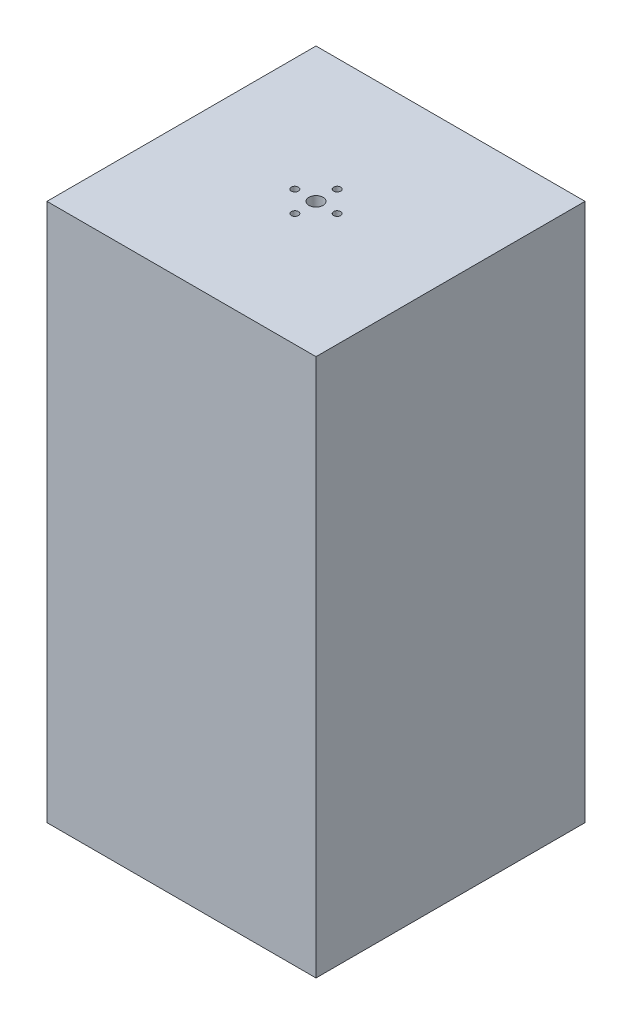
ISO-10303-21;
HEADER;
FILE_DESCRIPTION(('STEP AP214'),'2;1');
FILE_NAME('part.step','',(''),(''),'','','');
FILE_SCHEMA(('AUTOMOTIVE_DESIGN { 1 0 10303 214 1 1 1 1 }'));
ENDSEC;
DATA;
#1=APPLICATION_CONTEXT('core data for automotive mechanical design processes');
#2=APPLICATION_PROTOCOL_DEFINITION('international standard','automotive_design',2000,#1);
#3=PRODUCT_CONTEXT('',#1,'mechanical');
#4=PRODUCT('Part','Part','',(#3));
#5=PRODUCT_RELATED_PRODUCT_CATEGORY('part','',(#4));
#6=PRODUCT_DEFINITION_FORMATION('','',#4);
#7=PRODUCT_DEFINITION_CONTEXT('part definition',#1,'design');
#8=PRODUCT_DEFINITION('design','',#6,#7);
#9=PRODUCT_DEFINITION_SHAPE('','',#8);
#10=(LENGTH_UNIT() NAMED_UNIT(*) SI_UNIT(.MILLI.,.METRE.));
#11=(NAMED_UNIT(*) PLANE_ANGLE_UNIT() SI_UNIT($,.RADIAN.));
#12=(NAMED_UNIT(*) SI_UNIT($,.STERADIAN.) SOLID_ANGLE_UNIT());
#13=UNCERTAINTY_MEASURE_WITH_UNIT(LENGTH_MEASURE(1.E-05),#10,'distance_accuracy_value','');
#14=(GEOMETRIC_REPRESENTATION_CONTEXT(3) GLOBAL_UNCERTAINTY_ASSIGNED_CONTEXT((#13)) GLOBAL_UNIT_ASSIGNED_CONTEXT((#10,
#11,#12)) REPRESENTATION_CONTEXT('',''));
#15=CARTESIAN_POINT('',(0.,0.,0.));
#16=DIRECTION('',(0.,0.,1.));
#17=DIRECTION('',(1.,0.,0.));
#18=AXIS2_PLACEMENT_3D('',#15,#16,#17);
#19=CARTESIAN_POINT('',(0.,0.,-76.2));
#20=DIRECTION('',(-1.,0.,0.));
#21=DIRECTION('',(0.,0.,1.));
#22=AXIS2_PLACEMENT_3D('',#19,#20,#21);
#23=PLANE('',#22);
#24=DIRECTION('',(0.,-1.,0.));
#25=VECTOR('',#24,1.);
#26=CARTESIAN_POINT('',(0.,0.,0.));
#27=LINE('',#26,#25);
#28=CARTESIAN_POINT('',(0.,152.4,0.));
#29=VERTEX_POINT('',#28);
#30=CARTESIAN_POINT('',(0.,0.,0.));
#31=VERTEX_POINT('',#30);
#32=EDGE_CURVE('E145',#29,#31,#27,.T.);
#33=ORIENTED_EDGE('',*,*,#32,.F.);
#34=DIRECTION('',(0.,0.,1.));
#35=VECTOR('',#34,1.);
#36=CARTESIAN_POINT('',(0.,152.4,-76.2));
#37=LINE('',#36,#35);
#38=CARTESIAN_POINT('',(0.,152.4,-76.2));
#39=VERTEX_POINT('',#38);
#40=EDGE_CURVE('E11',#39,#29,#37,.T.);
#41=ORIENTED_EDGE('',*,*,#40,.F.);
#42=DIRECTION('',(0.,-1.,0.));
#43=VECTOR('',#42,1.);
#44=CARTESIAN_POINT('',(0.,0.,-76.2));
#45=LINE('',#44,#43);
#46=CARTESIAN_POINT('',(0.,0.,-76.2));
#47=VERTEX_POINT('',#46);
#48=EDGE_CURVE('E149',#39,#47,#45,.T.);
#49=ORIENTED_EDGE('',*,*,#48,.T.);
#50=DIRECTION('',(0.,0.,1.));
#51=VECTOR('',#50,1.);
#52=CARTESIAN_POINT('',(0.,0.,-76.2));
#53=LINE('',#52,#51);
#54=EDGE_CURVE('E83',#47,#31,#53,.T.);
#55=ORIENTED_EDGE('',*,*,#54,.T.);
#56=EDGE_LOOP('',(#33,#41,#49,#55));
#57=FACE_BOUND('',#56,.T.);
#58=ADVANCED_FACE('F34',(#57),#23,.T.);
#59=CARTESIAN_POINT('',(0.,152.4,-76.2));
#60=DIRECTION('',(0.,1.,0.));
#61=DIRECTION('',(-1.,0.,0.));
#62=AXIS2_PLACEMENT_3D('',#59,#60,#61);
#63=PLANE('',#62);
#64=CARTESIAN_POINT('',(38.1,152.4,-32.1));
#65=DIRECTION('',(0.,1.,0.));
#66=DIRECTION('',(-1.,0.,0.));
#67=AXIS2_PLACEMENT_3D('',#64,#65,#66);
#68=CIRCLE('',#67,0.999999999999998);
#69=CARTESIAN_POINT('',(37.1,152.4,-32.1));
#70=VERTEX_POINT('',#69);
#71=EDGE_CURVE('E177',#70,#70,#68,.T.);
#72=ORIENTED_EDGE('',*,*,#71,.F.);
#73=EDGE_LOOP('',(#72));
#74=FACE_BOUND('',#73,.T.);
#75=CARTESIAN_POINT('',(32.1,152.4,-38.1));
#76=DIRECTION('',(0.,1.,0.));
#77=DIRECTION('',(-1.,0.,0.));
#78=AXIS2_PLACEMENT_3D('',#75,#76,#77);
#79=CIRCLE('',#78,0.999999999999998);
#80=CARTESIAN_POINT('',(31.1,152.4,-38.1));
#81=VERTEX_POINT('',#80);
#82=EDGE_CURVE('E216',#81,#81,#79,.T.);
#83=ORIENTED_EDGE('',*,*,#82,.F.);
#84=EDGE_LOOP('',(#83));
#85=FACE_BOUND('',#84,.T.);
#86=CARTESIAN_POINT('',(44.1,152.4,-38.1));
#87=DIRECTION('',(0.,1.,0.));
#88=DIRECTION('',(-1.,0.,0.));
#89=AXIS2_PLACEMENT_3D('',#86,#87,#88);
#90=CIRCLE('',#89,0.999999999999998);
#91=CARTESIAN_POINT('',(43.1,152.4,-38.1));
#92=VERTEX_POINT('',#91);
#93=EDGE_CURVE('E214',#92,#92,#90,.T.);
#94=ORIENTED_EDGE('',*,*,#93,.F.);
#95=EDGE_LOOP('',(#94));
#96=FACE_BOUND('',#95,.T.);
#97=CARTESIAN_POINT('',(38.1,152.4,-38.1));
#98=DIRECTION('',(0.,1.,0.));
#99=DIRECTION('',(-1.,0.,0.));
#100=AXIS2_PLACEMENT_3D('',#97,#98,#99);
#101=CIRCLE('',#100,2.);
#102=CARTESIAN_POINT('',(36.1,152.4,-38.1));
#103=VERTEX_POINT('',#102);
#104=EDGE_CURVE('E133',#103,#103,#101,.T.);
#105=ORIENTED_EDGE('',*,*,#104,.F.);
#106=EDGE_LOOP('',(#105));
#107=FACE_BOUND('',#106,.T.);
#108=CARTESIAN_POINT('',(38.1,152.4,-44.1));
#109=DIRECTION('',(0.,1.,0.));
#110=DIRECTION('',(-1.,0.,0.));
#111=AXIS2_PLACEMENT_3D('',#108,#109,#110);
#112=CIRCLE('',#111,0.999999999999998);
#113=CARTESIAN_POINT('',(37.1,152.4,-44.1));
#114=VERTEX_POINT('',#113);
#115=EDGE_CURVE('E209',#114,#114,#112,.T.);
#116=ORIENTED_EDGE('',*,*,#115,.F.);
#117=EDGE_LOOP('',(#116));
#118=FACE_BOUND('',#117,.T.);
#119=DIRECTION('',(-1.,0.,0.));
#120=VECTOR('',#119,1.);
#121=CARTESIAN_POINT('',(0.,152.4,0.));
#122=LINE('',#121,#120);
#123=CARTESIAN_POINT('',(76.2,152.4,0.));
#124=VERTEX_POINT('',#123);
#125=EDGE_CURVE('E152',#124,#29,#122,.T.);
#126=ORIENTED_EDGE('',*,*,#125,.F.);
#127=DIRECTION('',(0.,0.,1.));
#128=VECTOR('',#127,1.);
#129=CARTESIAN_POINT('',(76.2,152.4,-76.2));
#130=LINE('',#129,#128);
#131=CARTESIAN_POINT('',(76.2,152.4,-76.2));
#132=VERTEX_POINT('',#131);
#133=EDGE_CURVE('E42',#132,#124,#130,.T.);
#134=ORIENTED_EDGE('',*,*,#133,.F.);
#135=DIRECTION('',(-1.,0.,0.));
#136=VECTOR('',#135,1.);
#137=CARTESIAN_POINT('',(0.,152.4,-76.2));
#138=LINE('',#137,#136);
#139=EDGE_CURVE('E157',#132,#39,#138,.T.);
#140=ORIENTED_EDGE('',*,*,#139,.T.);
#141=ORIENTED_EDGE('',*,*,#40,.T.);
#142=EDGE_LOOP('',(#126,#134,#140,#141));
#143=FACE_BOUND('',#142,.T.);
#144=ADVANCED_FACE('F224',(#74,#85,#96,#107,#118,#143),#63,.T.);
#145=CARTESIAN_POINT('',(76.2,0.,-76.2));
#146=DIRECTION('',(1.,0.,0.));
#147=DIRECTION('',(0.,0.,-1.));
#148=AXIS2_PLACEMENT_3D('',#145,#146,#147);
#149=PLANE('',#148);
#150=DIRECTION('',(0.,1.,0.));
#151=VECTOR('',#150,1.);
#152=CARTESIAN_POINT('',(76.2,0.,0.));
#153=LINE('',#152,#151);
#154=CARTESIAN_POINT('',(76.2,0.,0.));
#155=VERTEX_POINT('',#154);
#156=EDGE_CURVE('E164',#155,#124,#153,.T.);
#157=ORIENTED_EDGE('',*,*,#156,.F.);
#158=DIRECTION('',(0.,0.,1.));
#159=VECTOR('',#158,1.);
#160=CARTESIAN_POINT('',(76.2,0.,-76.2));
#161=LINE('',#160,#159);
#162=CARTESIAN_POINT('',(76.2,0.,-76.2));
#163=VERTEX_POINT('',#162);
#164=EDGE_CURVE('E170',#163,#155,#161,.T.);
#165=ORIENTED_EDGE('',*,*,#164,.F.);
#166=DIRECTION('',(0.,1.,0.));
#167=VECTOR('',#166,1.);
#168=CARTESIAN_POINT('',(76.2,0.,-76.2));
#169=LINE('',#168,#167);
#170=EDGE_CURVE('E154',#163,#132,#169,.T.);
#171=ORIENTED_EDGE('',*,*,#170,.T.);
#172=ORIENTED_EDGE('',*,*,#133,.T.);
#173=EDGE_LOOP('',(#157,#165,#171,#172));
#174=FACE_BOUND('',#173,.T.);
#175=ADVANCED_FACE('F227',(#174),#149,.T.);
#176=CARTESIAN_POINT('',(0.,0.,-76.2));
#177=DIRECTION('',(0.,-1.,0.));
#178=DIRECTION('',(0.,0.,-1.));
#179=AXIS2_PLACEMENT_3D('',#176,#177,#178);
#180=PLANE('',#179);
#181=DIRECTION('',(0.,0.,-1.));
#182=VECTOR('',#181,1.);
#183=CARTESIAN_POINT('',(3.81,0.,-3.81));
#184=LINE('',#183,#182);
#185=CARTESIAN_POINT('',(3.81,0.,-3.81));
#186=VERTEX_POINT('',#185);
#187=CARTESIAN_POINT('',(3.81000000000001,0.,-72.39));
#188=VERTEX_POINT('',#187);
#189=EDGE_CURVE('E50',#186,#188,#184,.T.);
#190=ORIENTED_EDGE('',*,*,#189,.F.);
#191=DIRECTION('',(-1.,0.,0.));
#192=VECTOR('',#191,1.);
#193=CARTESIAN_POINT('',(3.81,0.,-3.81));
#194=LINE('',#193,#192);
#195=CARTESIAN_POINT('',(72.39,0.,-3.81));
#196=VERTEX_POINT('',#195);
#197=EDGE_CURVE('E127',#196,#186,#194,.T.);
#198=ORIENTED_EDGE('',*,*,#197,.F.);
#199=DIRECTION('',(0.,0.,1.));
#200=VECTOR('',#199,1.);
#201=CARTESIAN_POINT('',(72.39,0.,-3.81));
#202=LINE('',#201,#200);
#203=CARTESIAN_POINT('',(72.39,0.,-72.39));
#204=VERTEX_POINT('',#203);
#205=EDGE_CURVE('E130',#204,#196,#202,.T.);
#206=ORIENTED_EDGE('',*,*,#205,.F.);
#207=DIRECTION('',(1.,0.,0.));
#208=VECTOR('',#207,1.);
#209=CARTESIAN_POINT('',(3.81000000000001,0.,-72.39));
#210=LINE('',#209,#208);
#211=EDGE_CURVE('E139',#188,#204,#210,.T.);
#212=ORIENTED_EDGE('',*,*,#211,.F.);
#213=EDGE_LOOP('',(#190,#198,#206,#212));
#214=FACE_BOUND('',#213,.T.);
#215=DIRECTION('',(1.,0.,0.));
#216=VECTOR('',#215,1.);
#217=CARTESIAN_POINT('',(0.,0.,0.));
#218=LINE('',#217,#216);
#219=EDGE_CURVE('E161',#31,#155,#218,.T.);
#220=ORIENTED_EDGE('',*,*,#219,.F.);
#221=ORIENTED_EDGE('',*,*,#54,.F.);
#222=DIRECTION('',(1.,0.,0.));
#223=VECTOR('',#222,1.);
#224=CARTESIAN_POINT('',(0.,0.,-76.2));
#225=LINE('',#224,#223);
#226=EDGE_CURVE('E151',#47,#163,#225,.T.);
#227=ORIENTED_EDGE('',*,*,#226,.T.);
#228=ORIENTED_EDGE('',*,*,#164,.T.);
#229=EDGE_LOOP('',(#220,#221,#227,#228));
#230=FACE_BOUND('',#229,.T.);
#231=ADVANCED_FACE('F239',(#214,#230),#180,.T.);
#232=CARTESIAN_POINT('',(0.,0.,-76.2));
#233=DIRECTION('',(0.,0.,-1.));
#234=DIRECTION('',(-1.,0.,0.));
#235=AXIS2_PLACEMENT_3D('',#232,#233,#234);
#236=PLANE('',#235);
#237=ORIENTED_EDGE('',*,*,#48,.F.);
#238=ORIENTED_EDGE('',*,*,#139,.F.);
#239=ORIENTED_EDGE('',*,*,#170,.F.);
#240=ORIENTED_EDGE('',*,*,#226,.F.);
#241=EDGE_LOOP('',(#237,#238,#239,#240));
#242=FACE_BOUND('',#241,.T.);
#243=ADVANCED_FACE('F238',(#242),#236,.T.);
#244=CARTESIAN_POINT('',(0.,0.,0.));
#245=DIRECTION('',(0.,0.,-1.));
#246=DIRECTION('',(-1.,0.,0.));
#247=AXIS2_PLACEMENT_3D('',#244,#245,#246);
#248=PLANE('',#247);
#249=ORIENTED_EDGE('',*,*,#32,.T.);
#250=ORIENTED_EDGE('',*,*,#219,.T.);
#251=ORIENTED_EDGE('',*,*,#156,.T.);
#252=ORIENTED_EDGE('',*,*,#125,.T.);
#253=EDGE_LOOP('',(#249,#250,#251,#252));
#254=FACE_BOUND('',#253,.T.);
#255=ADVANCED_FACE('F232',(#254),#248,.F.);
#256=CARTESIAN_POINT('',(3.81,148.59,-3.81));
#257=DIRECTION('',(-1.,0.,0.));
#258=DIRECTION('',(0.,0.,1.));
#259=AXIS2_PLACEMENT_3D('',#256,#257,#258);
#260=PLANE('',#259);
#261=ORIENTED_EDGE('',*,*,#189,.T.);
#262=DIRECTION('',(0.,-1.,0.));
#263=VECTOR('',#262,1.);
#264=CARTESIAN_POINT('',(3.81000000000001,148.59,-72.39));
#265=LINE('',#264,#263);
#266=CARTESIAN_POINT('',(3.81000000000001,148.59,-72.39));
#267=VERTEX_POINT('',#266);
#268=EDGE_CURVE('E105',#267,#188,#265,.T.);
#269=ORIENTED_EDGE('',*,*,#268,.F.);
#270=DIRECTION('',(0.,0.,-1.));
#271=VECTOR('',#270,1.);
#272=CARTESIAN_POINT('',(3.81,148.59,-3.81));
#273=LINE('',#272,#271);
#274=CARTESIAN_POINT('',(3.81,148.59,-3.81));
#275=VERTEX_POINT('',#274);
#276=EDGE_CURVE('E109',#275,#267,#273,.T.);
#277=ORIENTED_EDGE('',*,*,#276,.F.);
#278=DIRECTION('',(0.,-1.,0.));
#279=VECTOR('',#278,1.);
#280=CARTESIAN_POINT('',(3.81,148.59,-3.81));
#281=LINE('',#280,#279);
#282=EDGE_CURVE('E143',#275,#186,#281,.T.);
#283=ORIENTED_EDGE('',*,*,#282,.T.);
#284=EDGE_LOOP('',(#261,#269,#277,#283));
#285=FACE_BOUND('',#284,.T.);
#286=ADVANCED_FACE('F107',(#285),#260,.F.);
#287=CARTESIAN_POINT('',(3.81,148.59,-3.81));
#288=DIRECTION('',(0.,0.,1.));
#289=DIRECTION('',(1.,0.,0.));
#290=AXIS2_PLACEMENT_3D('',#287,#288,#289);
#291=PLANE('',#290);
#292=ORIENTED_EDGE('',*,*,#197,.T.);
#293=ORIENTED_EDGE('',*,*,#282,.F.);
#294=DIRECTION('',(-1.,0.,0.));
#295=VECTOR('',#294,1.);
#296=CARTESIAN_POINT('',(3.81,148.59,-3.81));
#297=LINE('',#296,#295);
#298=CARTESIAN_POINT('',(72.39,148.59,-3.81));
#299=VERTEX_POINT('',#298);
#300=EDGE_CURVE('E115',#299,#275,#297,.T.);
#301=ORIENTED_EDGE('',*,*,#300,.F.);
#302=DIRECTION('',(0.,-1.,0.));
#303=VECTOR('',#302,1.);
#304=CARTESIAN_POINT('',(72.39,148.59,-3.81));
#305=LINE('',#304,#303);
#306=EDGE_CURVE('E146',#299,#196,#305,.T.);
#307=ORIENTED_EDGE('',*,*,#306,.T.);
#308=EDGE_LOOP('',(#292,#293,#301,#307));
#309=FACE_BOUND('',#308,.T.);
#310=ADVANCED_FACE('F288',(#309),#291,.F.);
#311=CARTESIAN_POINT('',(72.39,148.59,-3.81));
#312=DIRECTION('',(1.,0.,0.));
#313=DIRECTION('',(0.,0.,-1.));
#314=AXIS2_PLACEMENT_3D('',#311,#312,#313);
#315=PLANE('',#314);
#316=ORIENTED_EDGE('',*,*,#205,.T.);
#317=ORIENTED_EDGE('',*,*,#306,.F.);
#318=DIRECTION('',(0.,0.,1.));
#319=VECTOR('',#318,1.);
#320=CARTESIAN_POINT('',(72.39,148.59,-3.81));
#321=LINE('',#320,#319);
#322=CARTESIAN_POINT('',(72.39,148.59,-72.39));
#323=VERTEX_POINT('',#322);
#324=EDGE_CURVE('E123',#323,#299,#321,.T.);
#325=ORIENTED_EDGE('',*,*,#324,.F.);
#326=DIRECTION('',(0.,-1.,0.));
#327=VECTOR('',#326,1.);
#328=CARTESIAN_POINT('',(72.39,148.59,-72.39));
#329=LINE('',#328,#327);
#330=EDGE_CURVE('E114',#323,#204,#329,.T.);
#331=ORIENTED_EDGE('',*,*,#330,.T.);
#332=EDGE_LOOP('',(#316,#317,#325,#331));
#333=FACE_BOUND('',#332,.T.);
#334=ADVANCED_FACE('F297',(#333),#315,.F.);
#335=CARTESIAN_POINT('',(3.81000000000001,148.59,-72.39));
#336=DIRECTION('',(0.,0.,-1.));
#337=DIRECTION('',(-1.,0.,0.));
#338=AXIS2_PLACEMENT_3D('',#335,#336,#337);
#339=PLANE('',#338);
#340=ORIENTED_EDGE('',*,*,#211,.T.);
#341=ORIENTED_EDGE('',*,*,#330,.F.);
#342=DIRECTION('',(1.,0.,0.));
#343=VECTOR('',#342,1.);
#344=CARTESIAN_POINT('',(3.81000000000001,148.59,-72.39));
#345=LINE('',#344,#343);
#346=EDGE_CURVE('E118',#267,#323,#345,.T.);
#347=ORIENTED_EDGE('',*,*,#346,.F.);
#348=ORIENTED_EDGE('',*,*,#268,.T.);
#349=EDGE_LOOP('',(#340,#341,#347,#348));
#350=FACE_BOUND('',#349,.T.);
#351=ADVANCED_FACE('F119',(#350),#339,.F.);
#352=CARTESIAN_POINT('',(0.,148.59,0.));
#353=DIRECTION('',(0.,-1.,0.));
#354=DIRECTION('',(0.,0.,-1.));
#355=AXIS2_PLACEMENT_3D('',#352,#353,#354);
#356=PLANE('',#355);
#357=CARTESIAN_POINT('',(38.1,148.59,-32.1));
#358=DIRECTION('',(0.,-1.,0.));
#359=DIRECTION('',(0.,0.,-1.));
#360=AXIS2_PLACEMENT_3D('',#357,#358,#359);
#361=CIRCLE('',#360,0.999999999999998);
#362=CARTESIAN_POINT('',(38.1,148.59,-33.1));
#363=VERTEX_POINT('',#362);
#364=EDGE_CURVE('E37',#363,#363,#361,.T.);
#365=ORIENTED_EDGE('',*,*,#364,.F.);
#366=EDGE_LOOP('',(#365));
#367=FACE_BOUND('',#366,.T.);
#368=CARTESIAN_POINT('',(32.1,148.59,-38.1));
#369=DIRECTION('',(0.,-1.,0.));
#370=DIRECTION('',(0.,0.,-1.));
#371=AXIS2_PLACEMENT_3D('',#368,#369,#370);
#372=CIRCLE('',#371,0.999999999999998);
#373=CARTESIAN_POINT('',(32.1,148.59,-39.1));
#374=VERTEX_POINT('',#373);
#375=EDGE_CURVE('E182',#374,#374,#372,.T.);
#376=ORIENTED_EDGE('',*,*,#375,.F.);
#377=EDGE_LOOP('',(#376));
#378=FACE_BOUND('',#377,.T.);
#379=CARTESIAN_POINT('',(44.1,148.59,-38.1));
#380=DIRECTION('',(0.,-1.,0.));
#381=DIRECTION('',(0.,0.,-1.));
#382=AXIS2_PLACEMENT_3D('',#379,#380,#381);
#383=CIRCLE('',#382,0.999999999999998);
#384=CARTESIAN_POINT('',(44.1,148.59,-39.1));
#385=VERTEX_POINT('',#384);
#386=EDGE_CURVE('E180',#385,#385,#383,.T.);
#387=ORIENTED_EDGE('',*,*,#386,.F.);
#388=EDGE_LOOP('',(#387));
#389=FACE_BOUND('',#388,.T.);
#390=CARTESIAN_POINT('',(38.1,148.59,-38.1));
#391=DIRECTION('',(0.,-1.,0.));
#392=DIRECTION('',(0.,0.,-1.));
#393=AXIS2_PLACEMENT_3D('',#390,#391,#392);
#394=CIRCLE('',#393,2.);
#395=CARTESIAN_POINT('',(38.1,148.59,-40.1));
#396=VERTEX_POINT('',#395);
#397=EDGE_CURVE('E176',#396,#396,#394,.T.);
#398=ORIENTED_EDGE('',*,*,#397,.F.);
#399=EDGE_LOOP('',(#398));
#400=FACE_BOUND('',#399,.T.);
#401=CARTESIAN_POINT('',(38.1,148.59,-44.1));
#402=DIRECTION('',(0.,-1.,0.));
#403=DIRECTION('',(0.,0.,-1.));
#404=AXIS2_PLACEMENT_3D('',#401,#402,#403);
#405=CIRCLE('',#404,0.999999999999998);
#406=CARTESIAN_POINT('',(38.1,148.59,-45.1));
#407=VERTEX_POINT('',#406);
#408=EDGE_CURVE('E173',#407,#407,#405,.T.);
#409=ORIENTED_EDGE('',*,*,#408,.F.);
#410=EDGE_LOOP('',(#409));
#411=FACE_BOUND('',#410,.T.);
#412=ORIENTED_EDGE('',*,*,#276,.T.);
#413=ORIENTED_EDGE('',*,*,#346,.T.);
#414=ORIENTED_EDGE('',*,*,#324,.T.);
#415=ORIENTED_EDGE('',*,*,#300,.T.);
#416=EDGE_LOOP('',(#412,#413,#414,#415));
#417=FACE_BOUND('',#416,.T.);
#418=ADVANCED_FACE('F125',(#367,#378,#389,#400,#411,#417),#356,.T.);
#419=CARTESIAN_POINT('',(38.0999999999999,0.,-44.1));
#420=DIRECTION('',(0.,1.,0.));
#421=DIRECTION('',(-1.,0.,0.));
#422=AXIS2_PLACEMENT_3D('',#419,#420,#421);
#423=CYLINDRICAL_SURFACE('',#422,0.999999999999998);
#424=ORIENTED_EDGE('',*,*,#408,.T.);
#425=EDGE_LOOP('',(#424));
#426=FACE_BOUND('',#425,.T.);
#427=ORIENTED_EDGE('',*,*,#115,.T.);
#428=EDGE_LOOP('',(#427));
#429=FACE_BOUND('',#428,.T.);
#430=ADVANCED_FACE('F194',(#426,#429),#423,.F.);
#431=CARTESIAN_POINT('',(38.0999999999999,0.,-38.1));
#432=DIRECTION('',(0.,1.,0.));
#433=DIRECTION('',(-1.,0.,0.));
#434=AXIS2_PLACEMENT_3D('',#431,#432,#433);
#435=CYLINDRICAL_SURFACE('',#434,2.);
#436=ORIENTED_EDGE('',*,*,#397,.T.);
#437=EDGE_LOOP('',(#436));
#438=FACE_BOUND('',#437,.T.);
#439=ORIENTED_EDGE('',*,*,#104,.T.);
#440=EDGE_LOOP('',(#439));
#441=FACE_BOUND('',#440,.T.);
#442=ADVANCED_FACE('F205',(#438,#441),#435,.F.);
#443=CARTESIAN_POINT('',(44.0999999999999,0.,-38.1));
#444=DIRECTION('',(0.,1.,0.));
#445=DIRECTION('',(-1.,0.,0.));
#446=AXIS2_PLACEMENT_3D('',#443,#444,#445);
#447=CYLINDRICAL_SURFACE('',#446,0.999999999999998);
#448=ORIENTED_EDGE('',*,*,#386,.T.);
#449=EDGE_LOOP('',(#448));
#450=FACE_BOUND('',#449,.T.);
#451=ORIENTED_EDGE('',*,*,#93,.T.);
#452=EDGE_LOOP('',(#451));
#453=FACE_BOUND('',#452,.T.);
#454=ADVANCED_FACE('F222',(#450,#453),#447,.F.);
#455=CARTESIAN_POINT('',(32.0999999999999,0.,-38.1));
#456=DIRECTION('',(0.,1.,0.));
#457=DIRECTION('',(-1.,0.,0.));
#458=AXIS2_PLACEMENT_3D('',#455,#456,#457);
#459=CYLINDRICAL_SURFACE('',#458,0.999999999999998);
#460=ORIENTED_EDGE('',*,*,#375,.T.);
#461=EDGE_LOOP('',(#460));
#462=FACE_BOUND('',#461,.T.);
#463=ORIENTED_EDGE('',*,*,#82,.T.);
#464=EDGE_LOOP('',(#463));
#465=FACE_BOUND('',#464,.T.);
#466=ADVANCED_FACE('F336',(#462,#465),#459,.F.);
#467=CARTESIAN_POINT('',(38.0999999999999,0.,-32.1));
#468=DIRECTION('',(0.,1.,0.));
#469=DIRECTION('',(-1.,0.,0.));
#470=AXIS2_PLACEMENT_3D('',#467,#468,#469);
#471=CYLINDRICAL_SURFACE('',#470,0.999999999999998);
#472=ORIENTED_EDGE('',*,*,#364,.T.);
#473=EDGE_LOOP('',(#472));
#474=FACE_BOUND('',#473,.T.);
#475=ORIENTED_EDGE('',*,*,#71,.T.);
#476=EDGE_LOOP('',(#475));
#477=FACE_BOUND('',#476,.T.);
#478=ADVANCED_FACE('F189',(#474,#477),#471,.F.);
#479=CLOSED_SHELL('',(#58,#144,#175,#231,#243,#255,#286,#310,#334,#351,#418,#430,#442,#454,#466,#478));
#480=MANIFOLD_SOLID_BREP('B2',#479);
#481=ADVANCED_BREP_SHAPE_REPRESENTATION('',(#18,#480),#14);
#482=SHAPE_DEFINITION_REPRESENTATION(#9,#481);
ENDSEC;
END-ISO-10303-21;
